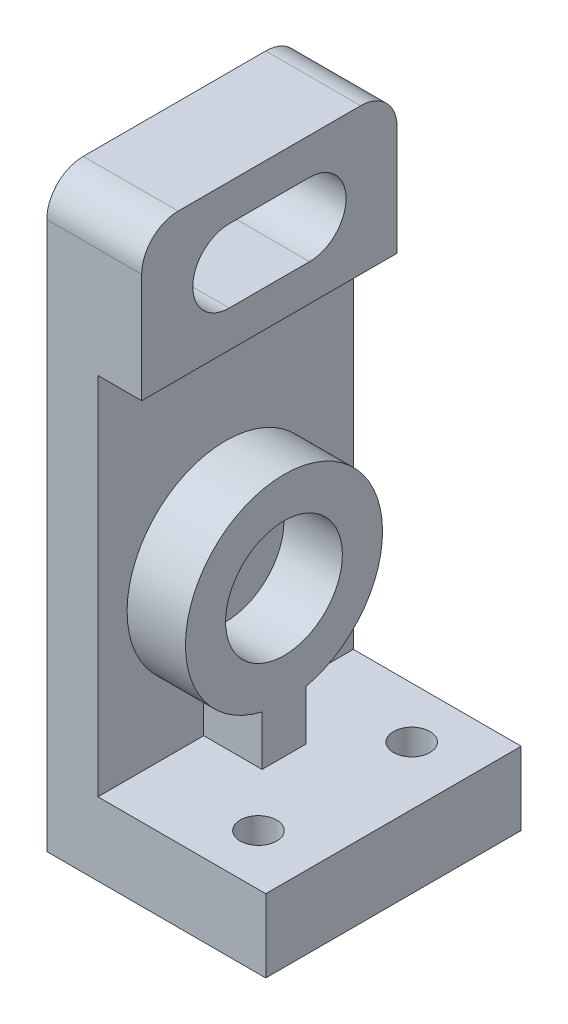
ISO-10303-21;
HEADER;
FILE_DESCRIPTION(('STEP AP214'),'2;1');
FILE_NAME('part.step','',(''),(''),'','','');
FILE_SCHEMA(('AUTOMOTIVE_DESIGN { 1 0 10303 214 1 1 1 1 }'));
ENDSEC;
DATA;
#1=APPLICATION_CONTEXT('core data for automotive mechanical design processes');
#2=APPLICATION_PROTOCOL_DEFINITION('international standard','automotive_design',2000,#1);
#3=PRODUCT_CONTEXT('',#1,'mechanical');
#4=PRODUCT('Part','Part','',(#3));
#5=PRODUCT_RELATED_PRODUCT_CATEGORY('part','',(#4));
#6=PRODUCT_DEFINITION_FORMATION('','',#4);
#7=PRODUCT_DEFINITION_CONTEXT('part definition',#1,'design');
#8=PRODUCT_DEFINITION('design','',#6,#7);
#9=PRODUCT_DEFINITION_SHAPE('','',#8);
#10=(LENGTH_UNIT() NAMED_UNIT(*) SI_UNIT(.MILLI.,.METRE.));
#11=(NAMED_UNIT(*) PLANE_ANGLE_UNIT() SI_UNIT($,.RADIAN.));
#12=(NAMED_UNIT(*) SI_UNIT($,.STERADIAN.) SOLID_ANGLE_UNIT());
#13=UNCERTAINTY_MEASURE_WITH_UNIT(LENGTH_MEASURE(1.E-05),#10,'distance_accuracy_value','');
#14=(GEOMETRIC_REPRESENTATION_CONTEXT(3) GLOBAL_UNCERTAINTY_ASSIGNED_CONTEXT((#13)) GLOBAL_UNIT_ASSIGNED_CONTEXT((#10,
#11,#12)) REPRESENTATION_CONTEXT('',''));
#15=CARTESIAN_POINT('',(0.,0.,0.));
#16=DIRECTION('',(0.,0.,1.));
#17=DIRECTION('',(1.,0.,0.));
#18=AXIS2_PLACEMENT_3D('',#15,#16,#17);
#19=CARTESIAN_POINT('',(0.,10.,0.));
#20=DIRECTION('',(0.,1.,0.));
#21=DIRECTION('',(0.,0.,1.));
#22=AXIS2_PLACEMENT_3D('',#19,#20,#21);
#23=PLANE('',#22);
#24=CARTESIAN_POINT('',(7.,10.,-10.5));
#25=DIRECTION('',(0.,1.,0.));
#26=DIRECTION('',(0.,0.,1.));
#27=AXIS2_PLACEMENT_3D('',#24,#25,#26);
#28=CIRCLE('',#27,2.5);
#29=CARTESIAN_POINT('',(7.,10.,-8.));
#30=VERTEX_POINT('',#29);
#31=EDGE_CURVE('E204',#30,#30,#28,.T.);
#32=ORIENTED_EDGE('',*,*,#31,.F.);
#33=EDGE_LOOP('',(#32));
#34=FACE_BOUND('',#33,.T.);
#35=CARTESIAN_POINT('',(7.,10.,10.5));
#36=DIRECTION('',(0.,1.,0.));
#37=DIRECTION('',(0.,0.,1.));
#38=AXIS2_PLACEMENT_3D('',#35,#36,#37);
#39=CIRCLE('',#38,2.5);
#40=CARTESIAN_POINT('',(7.,10.,13.));
#41=VERTEX_POINT('',#40);
#42=EDGE_CURVE('E180',#41,#41,#39,.T.);
#43=ORIENTED_EDGE('',*,*,#42,.F.);
#44=EDGE_LOOP('',(#43));
#45=FACE_BOUND('',#44,.T.);
#46=DIRECTION('',(0.,0.,-1.));
#47=VECTOR('',#46,1.);
#48=CARTESIAN_POINT('',(0.,10.,3.));
#49=LINE('',#48,#47);
#50=CARTESIAN_POINT('',(0.,10.,3.));
#51=VERTEX_POINT('',#50);
#52=CARTESIAN_POINT('',(0.,10.,-3.));
#53=VERTEX_POINT('',#52);
#54=EDGE_CURVE('E163',#51,#53,#49,.T.);
#55=ORIENTED_EDGE('',*,*,#54,.F.);
#56=DIRECTION('',(-1.,0.,0.));
#57=VECTOR('',#56,1.);
#58=CARTESIAN_POINT('',(0.,10.,3.));
#59=LINE('',#58,#57);
#60=CARTESIAN_POINT('',(-8.,10.,3.));
#61=VERTEX_POINT('',#60);
#62=EDGE_CURVE('E173',#51,#61,#59,.T.);
#63=ORIENTED_EDGE('',*,*,#62,.T.);
#64=DIRECTION('',(0.,0.,-1.));
#65=VECTOR('',#64,1.);
#66=CARTESIAN_POINT('',(-8.,10.,17.5));
#67=LINE('',#66,#65);
#68=CARTESIAN_POINT('',(-8.,10.,17.5));
#69=VERTEX_POINT('',#68);
#70=EDGE_CURVE('E263',#69,#61,#67,.T.);
#71=ORIENTED_EDGE('',*,*,#70,.F.);
#72=DIRECTION('',(1.,0.,0.));
#73=VECTOR('',#72,1.);
#74=CARTESIAN_POINT('',(-15.,10.,17.5));
#75=LINE('',#74,#73);
#76=CARTESIAN_POINT('',(15.,10.,17.5));
#77=VERTEX_POINT('',#76);
#78=EDGE_CURVE('E277',#69,#77,#75,.T.);
#79=ORIENTED_EDGE('',*,*,#78,.T.);
#80=DIRECTION('',(0.,0.,-1.));
#81=VECTOR('',#80,1.);
#82=CARTESIAN_POINT('',(15.,10.,-17.5));
#83=LINE('',#82,#81);
#84=CARTESIAN_POINT('',(15.,10.,-17.5));
#85=VERTEX_POINT('',#84);
#86=EDGE_CURVE('E270',#77,#85,#83,.T.);
#87=ORIENTED_EDGE('',*,*,#86,.T.);
#88=DIRECTION('',(-1.,0.,0.));
#89=VECTOR('',#88,1.);
#90=CARTESIAN_POINT('',(-15.,10.,-17.5));
#91=LINE('',#90,#89);
#92=CARTESIAN_POINT('',(-8.,10.,-17.5));
#93=VERTEX_POINT('',#92);
#94=EDGE_CURVE('E273',#85,#93,#91,.T.);
#95=ORIENTED_EDGE('',*,*,#94,.T.);
#96=CARTESIAN_POINT('',(-8.,10.,-3.));
#97=VERTEX_POINT('',#96);
#98=EDGE_CURVE('E258',#97,#93,#67,.T.);
#99=ORIENTED_EDGE('',*,*,#98,.F.);
#100=DIRECTION('',(-1.,0.,0.));
#101=VECTOR('',#100,1.);
#102=CARTESIAN_POINT('',(0.,10.,-3.));
#103=LINE('',#102,#101);
#104=EDGE_CURVE('E181',#53,#97,#103,.T.);
#105=ORIENTED_EDGE('',*,*,#104,.F.);
#106=EDGE_LOOP('',(#55,#63,#71,#79,#87,#95,#99,#105));
#107=FACE_BOUND('',#106,.T.);
#108=ADVANCED_FACE('F35',(#34,#45,#107),#23,.T.);
#109=CARTESIAN_POINT('',(-8.,80.,17.5));
#110=DIRECTION('',(-1.,0.,0.));
#111=DIRECTION('',(0.,0.,1.));
#112=AXIS2_PLACEMENT_3D('',#109,#110,#111);
#113=PLANE('',#112);
#114=DIRECTION('',(0.,-1.,0.));
#115=VECTOR('',#114,1.);
#116=CARTESIAN_POINT('',(-8.,10.,3.));
#117=LINE('',#116,#115);
#118=CARTESIAN_POINT('',(-8.,16.8375534189118,3.00000000000001));
#119=VERTEX_POINT('',#118);
#120=EDGE_CURVE('E176',#119,#61,#117,.T.);
#121=ORIENTED_EDGE('',*,*,#120,.F.);
#122=CARTESIAN_POINT('',(-8.,30.,0.));
#123=DIRECTION('',(1.,0.,0.));
#124=DIRECTION('',(0.,0.,-1.));
#125=AXIS2_PLACEMENT_3D('',#122,#123,#124);
#126=CIRCLE('',#125,13.5);
#127=CARTESIAN_POINT('',(-8.,16.8375534189118,-3.));
#128=VERTEX_POINT('',#127);
#129=EDGE_CURVE('E170',#128,#119,#126,.T.);
#130=ORIENTED_EDGE('',*,*,#129,.F.);
#131=DIRECTION('',(0.,1.,0.));
#132=VECTOR('',#131,1.);
#133=CARTESIAN_POINT('',(-8.,10.,-3.));
#134=LINE('',#133,#132);
#135=EDGE_CURVE('E191',#97,#128,#134,.T.);
#136=ORIENTED_EDGE('',*,*,#135,.F.);
#137=ORIENTED_EDGE('',*,*,#98,.T.);
#138=DIRECTION('',(0.,-1.,0.));
#139=VECTOR('',#138,1.);
#140=CARTESIAN_POINT('',(-8.,80.,-17.5));
#141=LINE('',#140,#139);
#142=CARTESIAN_POINT('',(-8.,60.,-17.5));
#143=VERTEX_POINT('',#142);
#144=EDGE_CURVE('E262',#143,#93,#141,.T.);
#145=ORIENTED_EDGE('',*,*,#144,.F.);
#146=DIRECTION('',(0.,0.,-1.));
#147=VECTOR('',#146,1.);
#148=CARTESIAN_POINT('',(-8.,60.,17.5));
#149=LINE('',#148,#147);
#150=CARTESIAN_POINT('',(-8.,60.,17.5));
#151=VERTEX_POINT('',#150);
#152=EDGE_CURVE('E235',#151,#143,#149,.T.);
#153=ORIENTED_EDGE('',*,*,#152,.F.);
#154=DIRECTION('',(0.,-1.,0.));
#155=VECTOR('',#154,1.);
#156=CARTESIAN_POINT('',(-8.,80.,17.5));
#157=LINE('',#156,#155);
#158=EDGE_CURVE('E267',#151,#69,#157,.T.);
#159=ORIENTED_EDGE('',*,*,#158,.T.);
#160=ORIENTED_EDGE('',*,*,#70,.T.);
#161=EDGE_LOOP('',(#121,#130,#136,#137,#145,#153,#159,#160));
#162=FACE_BOUND('',#161,.T.);
#163=ADVANCED_FACE('F352',(#162),#113,.F.);
#164=CARTESIAN_POINT('',(15.,10.,-17.5));
#165=DIRECTION('',(-1.,0.,0.));
#166=DIRECTION('',(0.,0.,1.));
#167=AXIS2_PLACEMENT_3D('',#164,#165,#166);
#168=PLANE('',#167);
#169=DIRECTION('',(0.,0.,-1.));
#170=VECTOR('',#169,1.);
#171=CARTESIAN_POINT('',(15.,0.,-17.5));
#172=LINE('',#171,#170);
#173=CARTESIAN_POINT('',(15.,0.,17.5));
#174=VERTEX_POINT('',#173);
#175=CARTESIAN_POINT('',(15.,0.,-17.5));
#176=VERTEX_POINT('',#175);
#177=EDGE_CURVE('E269',#174,#176,#172,.T.);
#178=ORIENTED_EDGE('',*,*,#177,.T.);
#179=DIRECTION('',(0.,-1.,0.));
#180=VECTOR('',#179,1.);
#181=CARTESIAN_POINT('',(15.,10.,-17.5));
#182=LINE('',#181,#180);
#183=EDGE_CURVE('E295',#85,#176,#182,.T.);
#184=ORIENTED_EDGE('',*,*,#183,.F.);
#185=ORIENTED_EDGE('',*,*,#86,.F.);
#186=DIRECTION('',(0.,-1.,0.));
#187=VECTOR('',#186,1.);
#188=CARTESIAN_POINT('',(15.,10.,17.5));
#189=LINE('',#188,#187);
#190=EDGE_CURVE('E279',#77,#174,#189,.T.);
#191=ORIENTED_EDGE('',*,*,#190,.T.);
#192=EDGE_LOOP('',(#178,#184,#185,#191));
#193=FACE_BOUND('',#192,.T.);
#194=ADVANCED_FACE('F357',(#193),#168,.F.);
#195=CARTESIAN_POINT('',(-15.,10.,-17.5));
#196=DIRECTION('',(0.,0.,1.));
#197=DIRECTION('',(1.,0.,0.));
#198=AXIS2_PLACEMENT_3D('',#195,#196,#197);
#199=PLANE('',#198);
#200=DIRECTION('',(0.,-1.,0.));
#201=VECTOR('',#200,1.);
#202=CARTESIAN_POINT('',(-15.,10.,-17.5));
#203=LINE('',#202,#201);
#204=CARTESIAN_POINT('',(-15.,75.,-17.5));
#205=VERTEX_POINT('',#204);
#206=CARTESIAN_POINT('',(-15.,0.,-17.5));
#207=VERTEX_POINT('',#206);
#208=EDGE_CURVE('E293',#205,#207,#203,.T.);
#209=ORIENTED_EDGE('',*,*,#208,.F.);
#210=DIRECTION('',(-1.,0.,0.));
#211=VECTOR('',#210,1.);
#212=CARTESIAN_POINT('',(-15.,75.,-17.5));
#213=LINE('',#212,#211);
#214=CARTESIAN_POINT('',(-2.,75.,-17.5));
#215=VERTEX_POINT('',#214);
#216=EDGE_CURVE('E308',#205,#215,#213,.F.);
#217=ORIENTED_EDGE('',*,*,#216,.T.);
#218=DIRECTION('',(0.,1.,0.));
#219=VECTOR('',#218,1.);
#220=CARTESIAN_POINT('',(-2.,80.,-17.5));
#221=LINE('',#220,#219);
#222=CARTESIAN_POINT('',(-2.,60.,-17.5));
#223=VERTEX_POINT('',#222);
#224=EDGE_CURVE('E246',#223,#215,#221,.T.);
#225=ORIENTED_EDGE('',*,*,#224,.F.);
#226=DIRECTION('',(-1.,0.,0.));
#227=VECTOR('',#226,1.);
#228=CARTESIAN_POINT('',(-2.,60.,-17.5));
#229=LINE('',#228,#227);
#230=EDGE_CURVE('E252',#223,#143,#229,.T.);
#231=ORIENTED_EDGE('',*,*,#230,.T.);
#232=ORIENTED_EDGE('',*,*,#144,.T.);
#233=ORIENTED_EDGE('',*,*,#94,.F.);
#234=ORIENTED_EDGE('',*,*,#183,.T.);
#235=DIRECTION('',(-1.,0.,0.));
#236=VECTOR('',#235,1.);
#237=CARTESIAN_POINT('',(-15.,0.,-17.5));
#238=LINE('',#237,#236);
#239=EDGE_CURVE('E282',#176,#207,#238,.T.);
#240=ORIENTED_EDGE('',*,*,#239,.T.);
#241=EDGE_LOOP('',(#209,#217,#225,#231,#232,#233,#234,#240));
#242=FACE_BOUND('',#241,.T.);
#243=ADVANCED_FACE('F328',(#242),#199,.F.);
#244=CARTESIAN_POINT('',(-15.,10.,-17.5));
#245=DIRECTION('',(1.,0.,0.));
#246=DIRECTION('',(0.,0.,-1.));
#247=AXIS2_PLACEMENT_3D('',#244,#245,#246);
#248=PLANE('',#247);
#249=DIRECTION('',(0.,0.,1.));
#250=VECTOR('',#249,1.);
#251=CARTESIAN_POINT('',(-15.,75.,5.5));
#252=LINE('',#251,#250);
#253=CARTESIAN_POINT('',(-15.,75.,-5.5));
#254=VERTEX_POINT('',#253);
#255=CARTESIAN_POINT('',(-15.,75.,5.5));
#256=VERTEX_POINT('',#255);
#257=EDGE_CURVE('E220',#254,#256,#252,.T.);
#258=ORIENTED_EDGE('',*,*,#257,.T.);
#259=CARTESIAN_POINT('',(-15.,70.,5.5));
#260=DIRECTION('',(1.,0.,0.));
#261=DIRECTION('',(0.,0.,-1.));
#262=AXIS2_PLACEMENT_3D('',#259,#260,#261);
#263=CIRCLE('',#262,4.99999999999999);
#264=CARTESIAN_POINT('',(-15.,65.,5.5));
#265=VERTEX_POINT('',#264);
#266=EDGE_CURVE('E212',#256,#265,#263,.T.);
#267=ORIENTED_EDGE('',*,*,#266,.T.);
#268=DIRECTION('',(0.,0.,-1.));
#269=VECTOR('',#268,1.);
#270=CARTESIAN_POINT('',(-15.,65.,5.5));
#271=LINE('',#270,#269);
#272=CARTESIAN_POINT('',(-15.,65.,-5.5));
#273=VERTEX_POINT('',#272);
#274=EDGE_CURVE('E215',#265,#273,#271,.T.);
#275=ORIENTED_EDGE('',*,*,#274,.T.);
#276=CARTESIAN_POINT('',(-15.,70.,-5.5));
#277=DIRECTION('',(1.,0.,0.));
#278=DIRECTION('',(0.,0.,-1.));
#279=AXIS2_PLACEMENT_3D('',#276,#277,#278);
#280=CIRCLE('',#279,4.99999999999999);
#281=EDGE_CURVE('E58',#273,#254,#280,.T.);
#282=ORIENTED_EDGE('',*,*,#281,.T.);
#283=EDGE_LOOP('',(#258,#267,#275,#282));
#284=FACE_BOUND('',#283,.T.);
#285=DIRECTION('',(0.,0.,1.));
#286=VECTOR('',#285,1.);
#287=CARTESIAN_POINT('',(-15.,80.,17.5));
#288=LINE('',#287,#286);
#289=CARTESIAN_POINT('',(-15.,80.,-12.5));
#290=VERTEX_POINT('',#289);
#291=CARTESIAN_POINT('',(-15.,80.,12.5));
#292=VERTEX_POINT('',#291);
#293=EDGE_CURVE('E259',#290,#292,#288,.T.);
#294=ORIENTED_EDGE('',*,*,#293,.F.);
#295=CARTESIAN_POINT('',(-15.,75.,-12.5));
#296=DIRECTION('',(1.,0.,0.));
#297=DIRECTION('',(0.,0.,-1.));
#298=AXIS2_PLACEMENT_3D('',#295,#296,#297);
#299=CIRCLE('',#298,5.);
#300=EDGE_CURVE('E306',#290,#205,#299,.F.);
#301=ORIENTED_EDGE('',*,*,#300,.T.);
#302=ORIENTED_EDGE('',*,*,#208,.T.);
#303=DIRECTION('',(0.,0.,1.));
#304=VECTOR('',#303,1.);
#305=CARTESIAN_POINT('',(-15.,0.,-17.5));
#306=LINE('',#305,#304);
#307=CARTESIAN_POINT('',(-15.,0.,17.5));
#308=VERTEX_POINT('',#307);
#309=EDGE_CURVE('E285',#207,#308,#306,.T.);
#310=ORIENTED_EDGE('',*,*,#309,.T.);
#311=DIRECTION('',(0.,-1.,0.));
#312=VECTOR('',#311,1.);
#313=CARTESIAN_POINT('',(-15.,10.,17.5));
#314=LINE('',#313,#312);
#315=CARTESIAN_POINT('',(-15.,75.,17.5));
#316=VERTEX_POINT('',#315);
#317=EDGE_CURVE('E291',#316,#308,#314,.T.);
#318=ORIENTED_EDGE('',*,*,#317,.F.);
#319=CARTESIAN_POINT('',(-15.,75.,12.5));
#320=DIRECTION('',(1.,0.,0.));
#321=DIRECTION('',(0.,0.,-1.));
#322=AXIS2_PLACEMENT_3D('',#319,#320,#321);
#323=CIRCLE('',#322,5.);
#324=EDGE_CURVE('E304',#316,#292,#323,.F.);
#325=ORIENTED_EDGE('',*,*,#324,.T.);
#326=EDGE_LOOP('',(#294,#301,#302,#310,#318,#325));
#327=FACE_BOUND('',#326,.T.);
#328=ADVANCED_FACE('F326',(#284,#327),#248,.F.);
#329=CARTESIAN_POINT('',(-15.,10.,17.5));
#330=DIRECTION('',(0.,0.,-1.));
#331=DIRECTION('',(-1.,0.,0.));
#332=AXIS2_PLACEMENT_3D('',#329,#330,#331);
#333=PLANE('',#332);
#334=DIRECTION('',(0.,-1.,0.));
#335=VECTOR('',#334,1.);
#336=CARTESIAN_POINT('',(-2.,80.,17.5));
#337=LINE('',#336,#335);
#338=CARTESIAN_POINT('',(-2.,75.,17.5));
#339=VERTEX_POINT('',#338);
#340=CARTESIAN_POINT('',(-2.,60.,17.5));
#341=VERTEX_POINT('',#340);
#342=EDGE_CURVE('E242',#339,#341,#337,.T.);
#343=ORIENTED_EDGE('',*,*,#342,.F.);
#344=DIRECTION('',(1.,0.,0.));
#345=VECTOR('',#344,1.);
#346=CARTESIAN_POINT('',(-15.,75.,17.5));
#347=LINE('',#346,#345);
#348=EDGE_CURVE('E11',#339,#316,#347,.F.);
#349=ORIENTED_EDGE('',*,*,#348,.T.);
#350=ORIENTED_EDGE('',*,*,#317,.T.);
#351=DIRECTION('',(1.,0.,0.));
#352=VECTOR('',#351,1.);
#353=CARTESIAN_POINT('',(-15.,0.,17.5));
#354=LINE('',#353,#352);
#355=EDGE_CURVE('E274',#308,#174,#354,.T.);
#356=ORIENTED_EDGE('',*,*,#355,.T.);
#357=ORIENTED_EDGE('',*,*,#190,.F.);
#358=ORIENTED_EDGE('',*,*,#78,.F.);
#359=ORIENTED_EDGE('',*,*,#158,.F.);
#360=DIRECTION('',(-1.,0.,0.));
#361=VECTOR('',#360,1.);
#362=CARTESIAN_POINT('',(-2.,60.,17.5));
#363=LINE('',#362,#361);
#364=EDGE_CURVE('E256',#341,#151,#363,.T.);
#365=ORIENTED_EDGE('',*,*,#364,.F.);
#366=EDGE_LOOP('',(#343,#349,#350,#356,#357,#358,#359,#365));
#367=FACE_BOUND('',#366,.T.);
#368=ADVANCED_FACE('F343',(#367),#333,.F.);
#369=CARTESIAN_POINT('',(0.,0.,0.));
#370=DIRECTION('',(0.,1.,0.));
#371=DIRECTION('',(0.,0.,1.));
#372=AXIS2_PLACEMENT_3D('',#369,#370,#371);
#373=PLANE('',#372);
#374=CARTESIAN_POINT('',(7.,0.,-10.5));
#375=DIRECTION('',(0.,1.,0.));
#376=DIRECTION('',(0.,0.,1.));
#377=AXIS2_PLACEMENT_3D('',#374,#375,#376);
#378=CIRCLE('',#377,2.5);
#379=CARTESIAN_POINT('',(7.,0.,-8.));
#380=VERTEX_POINT('',#379);
#381=EDGE_CURVE('E200',#380,#380,#378,.T.);
#382=ORIENTED_EDGE('',*,*,#381,.T.);
#383=EDGE_LOOP('',(#382));
#384=FACE_BOUND('',#383,.T.);
#385=CARTESIAN_POINT('',(7.,0.,10.5));
#386=DIRECTION('',(0.,1.,0.));
#387=DIRECTION('',(0.,0.,1.));
#388=AXIS2_PLACEMENT_3D('',#385,#386,#387);
#389=CIRCLE('',#388,2.5);
#390=CARTESIAN_POINT('',(7.,0.,13.));
#391=VERTEX_POINT('',#390);
#392=EDGE_CURVE('E207',#391,#391,#389,.T.);
#393=ORIENTED_EDGE('',*,*,#392,.T.);
#394=EDGE_LOOP('',(#393));
#395=FACE_BOUND('',#394,.T.);
#396=ORIENTED_EDGE('',*,*,#177,.F.);
#397=ORIENTED_EDGE('',*,*,#355,.F.);
#398=ORIENTED_EDGE('',*,*,#309,.F.);
#399=ORIENTED_EDGE('',*,*,#239,.F.);
#400=EDGE_LOOP('',(#396,#397,#398,#399));
#401=FACE_BOUND('',#400,.T.);
#402=ADVANCED_FACE('F334',(#384,#395,#401),#373,.F.);
#403=CARTESIAN_POINT('',(0.,80.,0.));
#404=DIRECTION('',(0.,-1.,0.));
#405=DIRECTION('',(0.,0.,-1.));
#406=AXIS2_PLACEMENT_3D('',#403,#404,#405);
#407=PLANE('',#406);
#408=DIRECTION('',(0.,0.,1.));
#409=VECTOR('',#408,1.);
#410=CARTESIAN_POINT('',(-2.,80.,17.5));
#411=LINE('',#410,#409);
#412=CARTESIAN_POINT('',(-2.,80.,-12.5));
#413=VERTEX_POINT('',#412);
#414=CARTESIAN_POINT('',(-2.,80.,12.5));
#415=VERTEX_POINT('',#414);
#416=EDGE_CURVE('E249',#413,#415,#411,.T.);
#417=ORIENTED_EDGE('',*,*,#416,.F.);
#418=DIRECTION('',(-1.,0.,0.));
#419=VECTOR('',#418,1.);
#420=CARTESIAN_POINT('',(0.,80.,-12.5));
#421=LINE('',#420,#419);
#422=EDGE_CURVE('E301',#413,#290,#421,.T.);
#423=ORIENTED_EDGE('',*,*,#422,.T.);
#424=ORIENTED_EDGE('',*,*,#293,.T.);
#425=DIRECTION('',(1.,0.,0.));
#426=VECTOR('',#425,1.);
#427=CARTESIAN_POINT('',(0.,80.,12.5));
#428=LINE('',#427,#426);
#429=EDGE_CURVE('E298',#292,#415,#428,.T.);
#430=ORIENTED_EDGE('',*,*,#429,.T.);
#431=EDGE_LOOP('',(#417,#423,#424,#430));
#432=FACE_BOUND('',#431,.T.);
#433=ADVANCED_FACE('F320',(#432),#407,.F.);
#434=CARTESIAN_POINT('',(-2.,60.,17.5));
#435=DIRECTION('',(0.,1.,0.));
#436=DIRECTION('',(0.,0.,1.));
#437=AXIS2_PLACEMENT_3D('',#434,#435,#436);
#438=PLANE('',#437);
#439=ORIENTED_EDGE('',*,*,#152,.T.);
#440=ORIENTED_EDGE('',*,*,#230,.F.);
#441=DIRECTION('',(0.,0.,-1.));
#442=VECTOR('',#441,1.);
#443=CARTESIAN_POINT('',(-2.,60.,17.5));
#444=LINE('',#443,#442);
#445=EDGE_CURVE('E244',#341,#223,#444,.T.);
#446=ORIENTED_EDGE('',*,*,#445,.F.);
#447=ORIENTED_EDGE('',*,*,#364,.T.);
#448=EDGE_LOOP('',(#439,#440,#446,#447));
#449=FACE_BOUND('',#448,.T.);
#450=ADVANCED_FACE('F348',(#449),#438,.F.);
#451=CARTESIAN_POINT('',(-2.,0.,0.));
#452=DIRECTION('',(1.,0.,0.));
#453=DIRECTION('',(0.,0.,-1.));
#454=AXIS2_PLACEMENT_3D('',#451,#452,#453);
#455=PLANE('',#454);
#456=CARTESIAN_POINT('',(-2.,70.,5.5));
#457=DIRECTION('',(1.,0.,0.));
#458=DIRECTION('',(0.,0.,-1.));
#459=AXIS2_PLACEMENT_3D('',#456,#457,#458);
#460=CIRCLE('',#459,4.99999999999999);
#461=CARTESIAN_POINT('',(-2.,75.,5.5));
#462=VERTEX_POINT('',#461);
#463=CARTESIAN_POINT('',(-2.,65.,5.5));
#464=VERTEX_POINT('',#463);
#465=EDGE_CURVE('E203',#462,#464,#460,.T.);
#466=ORIENTED_EDGE('',*,*,#465,.F.);
#467=DIRECTION('',(0.,0.,1.));
#468=VECTOR('',#467,1.);
#469=CARTESIAN_POINT('',(-2.,75.,5.5));
#470=LINE('',#469,#468);
#471=CARTESIAN_POINT('',(-2.,75.,-5.5));
#472=VERTEX_POINT('',#471);
#473=EDGE_CURVE('E216',#472,#462,#470,.T.);
#474=ORIENTED_EDGE('',*,*,#473,.F.);
#475=CARTESIAN_POINT('',(-2.,70.,-5.5));
#476=DIRECTION('',(1.,0.,0.));
#477=DIRECTION('',(0.,0.,-1.));
#478=AXIS2_PLACEMENT_3D('',#475,#476,#477);
#479=CIRCLE('',#478,4.99999999999999);
#480=CARTESIAN_POINT('',(-2.,65.,-5.5));
#481=VERTEX_POINT('',#480);
#482=EDGE_CURVE('E228',#481,#472,#479,.T.);
#483=ORIENTED_EDGE('',*,*,#482,.F.);
#484=DIRECTION('',(0.,0.,-1.));
#485=VECTOR('',#484,1.);
#486=CARTESIAN_POINT('',(-2.,65.,5.5));
#487=LINE('',#486,#485);
#488=EDGE_CURVE('E225',#464,#481,#487,.T.);
#489=ORIENTED_EDGE('',*,*,#488,.F.);
#490=EDGE_LOOP('',(#466,#474,#483,#489));
#491=FACE_BOUND('',#490,.T.);
#492=ORIENTED_EDGE('',*,*,#224,.T.);
#493=CARTESIAN_POINT('',(-2.,75.,-12.5));
#494=DIRECTION('',(1.,0.,0.));
#495=DIRECTION('',(0.,0.,-1.));
#496=AXIS2_PLACEMENT_3D('',#493,#494,#495);
#497=CIRCLE('',#496,5.);
#498=EDGE_CURVE('E43',#215,#413,#497,.T.);
#499=ORIENTED_EDGE('',*,*,#498,.T.);
#500=ORIENTED_EDGE('',*,*,#416,.T.);
#501=CARTESIAN_POINT('',(-2.,75.,12.5));
#502=DIRECTION('',(1.,0.,0.));
#503=DIRECTION('',(0.,0.,-1.));
#504=AXIS2_PLACEMENT_3D('',#501,#502,#503);
#505=CIRCLE('',#504,5.);
#506=EDGE_CURVE('E310',#415,#339,#505,.T.);
#507=ORIENTED_EDGE('',*,*,#506,.T.);
#508=ORIENTED_EDGE('',*,*,#342,.T.);
#509=ORIENTED_EDGE('',*,*,#445,.T.);
#510=EDGE_LOOP('',(#492,#499,#500,#507,#508,#509));
#511=FACE_BOUND('',#510,.T.);
#512=ADVANCED_FACE('F314',(#491,#511),#455,.T.);
#513=CARTESIAN_POINT('',(0.,75.,-12.5));
#514=DIRECTION('',(-1.,0.,0.));
#515=DIRECTION('',(0.,0.,1.));
#516=AXIS2_PLACEMENT_3D('',#513,#514,#515);
#517=CYLINDRICAL_SURFACE('',#516,5.);
#518=ORIENTED_EDGE('',*,*,#498,.F.);
#519=ORIENTED_EDGE('',*,*,#216,.F.);
#520=ORIENTED_EDGE('',*,*,#300,.F.);
#521=ORIENTED_EDGE('',*,*,#422,.F.);
#522=EDGE_LOOP('',(#518,#519,#520,#521));
#523=FACE_BOUND('',#522,.T.);
#524=ADVANCED_FACE('F323',(#523),#517,.T.);
#525=CARTESIAN_POINT('',(0.,75.,12.5));
#526=DIRECTION('',(1.,0.,0.));
#527=DIRECTION('',(0.,0.,-1.));
#528=AXIS2_PLACEMENT_3D('',#525,#526,#527);
#529=CYLINDRICAL_SURFACE('',#528,5.);
#530=ORIENTED_EDGE('',*,*,#324,.F.);
#531=ORIENTED_EDGE('',*,*,#348,.F.);
#532=ORIENTED_EDGE('',*,*,#506,.F.);
#533=ORIENTED_EDGE('',*,*,#429,.F.);
#534=EDGE_LOOP('',(#530,#531,#532,#533));
#535=FACE_BOUND('',#534,.T.);
#536=ADVANCED_FACE('F37',(#535),#529,.T.);
#537=CARTESIAN_POINT('',(-15.,70.,5.5));
#538=DIRECTION('',(1.,0.,0.));
#539=DIRECTION('',(0.,0.,-1.));
#540=AXIS2_PLACEMENT_3D('',#537,#538,#539);
#541=CYLINDRICAL_SURFACE('',#540,4.99999999999999);
#542=ORIENTED_EDGE('',*,*,#465,.T.);
#543=DIRECTION('',(1.,0.,0.));
#544=VECTOR('',#543,1.);
#545=CARTESIAN_POINT('',(-15.,65.,5.5));
#546=LINE('',#545,#544);
#547=EDGE_CURVE('E223',#265,#464,#546,.T.);
#548=ORIENTED_EDGE('',*,*,#547,.F.);
#549=ORIENTED_EDGE('',*,*,#266,.F.);
#550=DIRECTION('',(1.,0.,0.));
#551=VECTOR('',#550,1.);
#552=CARTESIAN_POINT('',(-15.,75.,5.5));
#553=LINE('',#552,#551);
#554=EDGE_CURVE('E233',#256,#462,#553,.T.);
#555=ORIENTED_EDGE('',*,*,#554,.T.);
#556=EDGE_LOOP('',(#542,#548,#549,#555));
#557=FACE_BOUND('',#556,.T.);
#558=ADVANCED_FACE('F392',(#557),#541,.F.);
#559=CARTESIAN_POINT('',(-15.,75.,5.5));
#560=DIRECTION('',(0.,1.,0.));
#561=DIRECTION('',(0.,0.,1.));
#562=AXIS2_PLACEMENT_3D('',#559,#560,#561);
#563=PLANE('',#562);
#564=ORIENTED_EDGE('',*,*,#473,.T.);
#565=ORIENTED_EDGE('',*,*,#554,.F.);
#566=ORIENTED_EDGE('',*,*,#257,.F.);
#567=DIRECTION('',(1.,0.,0.));
#568=VECTOR('',#567,1.);
#569=CARTESIAN_POINT('',(-15.,75.,-5.5));
#570=LINE('',#569,#568);
#571=EDGE_CURVE('E236',#254,#472,#570,.T.);
#572=ORIENTED_EDGE('',*,*,#571,.T.);
#573=EDGE_LOOP('',(#564,#565,#566,#572));
#574=FACE_BOUND('',#573,.T.);
#575=ADVANCED_FACE('F388',(#574),#563,.F.);
#576=CARTESIAN_POINT('',(-15.,70.,-5.5));
#577=DIRECTION('',(1.,0.,0.));
#578=DIRECTION('',(0.,0.,-1.));
#579=AXIS2_PLACEMENT_3D('',#576,#577,#578);
#580=CYLINDRICAL_SURFACE('',#579,4.99999999999999);
#581=ORIENTED_EDGE('',*,*,#482,.T.);
#582=ORIENTED_EDGE('',*,*,#571,.F.);
#583=ORIENTED_EDGE('',*,*,#281,.F.);
#584=DIRECTION('',(1.,0.,0.));
#585=VECTOR('',#584,1.);
#586=CARTESIAN_POINT('',(-15.,65.,-5.5));
#587=LINE('',#586,#585);
#588=EDGE_CURVE('E238',#273,#481,#587,.T.);
#589=ORIENTED_EDGE('',*,*,#588,.T.);
#590=EDGE_LOOP('',(#581,#582,#583,#589));
#591=FACE_BOUND('',#590,.T.);
#592=ADVANCED_FACE('F398',(#591),#580,.F.);
#593=CARTESIAN_POINT('',(-15.,65.,5.5));
#594=DIRECTION('',(0.,-1.,0.));
#595=DIRECTION('',(0.,0.,-1.));
#596=AXIS2_PLACEMENT_3D('',#593,#594,#595);
#597=PLANE('',#596);
#598=ORIENTED_EDGE('',*,*,#488,.T.);
#599=ORIENTED_EDGE('',*,*,#588,.F.);
#600=ORIENTED_EDGE('',*,*,#274,.F.);
#601=ORIENTED_EDGE('',*,*,#547,.T.);
#602=EDGE_LOOP('',(#598,#599,#600,#601));
#603=FACE_BOUND('',#602,.T.);
#604=ADVANCED_FACE('F396',(#603),#597,.F.);
#605=CARTESIAN_POINT('',(7.,0.,10.5));
#606=DIRECTION('',(0.,1.,0.));
#607=DIRECTION('',(0.,0.,1.));
#608=AXIS2_PLACEMENT_3D('',#605,#606,#607);
#609=CYLINDRICAL_SURFACE('',#608,2.5);
#610=ORIENTED_EDGE('',*,*,#392,.F.);
#611=EDGE_LOOP('',(#610));
#612=FACE_BOUND('',#611,.T.);
#613=ORIENTED_EDGE('',*,*,#42,.T.);
#614=EDGE_LOOP('',(#613));
#615=FACE_BOUND('',#614,.T.);
#616=ADVANCED_FACE('F519',(#612,#615),#609,.F.);
#617=CARTESIAN_POINT('',(7.,0.,-10.5));
#618=DIRECTION('',(0.,1.,0.));
#619=DIRECTION('',(0.,0.,1.));
#620=AXIS2_PLACEMENT_3D('',#617,#618,#619);
#621=CYLINDRICAL_SURFACE('',#620,2.5);
#622=ORIENTED_EDGE('',*,*,#381,.F.);
#623=EDGE_LOOP('',(#622));
#624=FACE_BOUND('',#623,.T.);
#625=ORIENTED_EDGE('',*,*,#31,.T.);
#626=EDGE_LOOP('',(#625));
#627=FACE_BOUND('',#626,.T.);
#628=ADVANCED_FACE('F463',(#624,#627),#621,.F.);
#629=CARTESIAN_POINT('',(0.,30.,0.));
#630=DIRECTION('',(1.,0.,0.));
#631=DIRECTION('',(0.,0.,-1.));
#632=AXIS2_PLACEMENT_3D('',#629,#630,#631);
#633=PLANE('',#632);
#634=DIRECTION('',(0.,-1.,0.));
#635=VECTOR('',#634,1.);
#636=CARTESIAN_POINT('',(0.,10.,3.));
#637=LINE('',#636,#635);
#638=CARTESIAN_POINT('',(0.,16.8375534189118,3.00000000000001));
#639=VERTEX_POINT('',#638);
#640=EDGE_CURVE('E158',#639,#51,#637,.T.);
#641=ORIENTED_EDGE('',*,*,#640,.T.);
#642=ORIENTED_EDGE('',*,*,#54,.T.);
#643=DIRECTION('',(0.,1.,0.));
#644=VECTOR('',#643,1.);
#645=CARTESIAN_POINT('',(0.,10.,-3.));
#646=LINE('',#645,#644);
#647=CARTESIAN_POINT('',(0.,16.8375534189118,-3.));
#648=VERTEX_POINT('',#647);
#649=EDGE_CURVE('E50',#53,#648,#646,.T.);
#650=ORIENTED_EDGE('',*,*,#649,.T.);
#651=CARTESIAN_POINT('',(0.,30.,0.));
#652=DIRECTION('',(1.,0.,0.));
#653=DIRECTION('',(0.,0.,-1.));
#654=AXIS2_PLACEMENT_3D('',#651,#652,#653);
#655=CIRCLE('',#654,13.5);
#656=EDGE_CURVE('E166',#648,#639,#655,.T.);
#657=ORIENTED_EDGE('',*,*,#656,.T.);
#658=EDGE_LOOP('',(#641,#642,#650,#657));
#659=FACE_BOUND('',#658,.T.);
#660=CARTESIAN_POINT('',(0.,30.,0.));
#661=DIRECTION('',(1.,0.,0.));
#662=DIRECTION('',(0.,0.,-1.));
#663=AXIS2_PLACEMENT_3D('',#660,#661,#662);
#664=CIRCLE('',#663,8.);
#665=CARTESIAN_POINT('',(0.,30.,-8.));
#666=VERTEX_POINT('',#665);
#667=EDGE_CURVE('E192',#666,#666,#664,.T.);
#668=ORIENTED_EDGE('',*,*,#667,.F.);
#669=EDGE_LOOP('',(#668));
#670=FACE_BOUND('',#669,.T.);
#671=ADVANCED_FACE('F160',(#659,#670),#633,.T.);
#672=CARTESIAN_POINT('',(0.,10.,3.));
#673=DIRECTION('',(0.,0.,-1.));
#674=DIRECTION('',(-1.,0.,0.));
#675=AXIS2_PLACEMENT_3D('',#672,#673,#674);
#676=PLANE('',#675);
#677=ORIENTED_EDGE('',*,*,#120,.T.);
#678=ORIENTED_EDGE('',*,*,#62,.F.);
#679=ORIENTED_EDGE('',*,*,#640,.F.);
#680=DIRECTION('',(-1.,0.,0.));
#681=VECTOR('',#680,1.);
#682=CARTESIAN_POINT('',(0.,16.8375534189118,3.00000000000001));
#683=LINE('',#682,#681);
#684=EDGE_CURVE('E189',#639,#119,#683,.T.);
#685=ORIENTED_EDGE('',*,*,#684,.T.);
#686=EDGE_LOOP('',(#677,#678,#679,#685));
#687=FACE_BOUND('',#686,.T.);
#688=ADVANCED_FACE('F174',(#687),#676,.F.);
#689=CARTESIAN_POINT('',(0.,10.,-3.));
#690=DIRECTION('',(0.,0.,1.));
#691=DIRECTION('',(1.,0.,0.));
#692=AXIS2_PLACEMENT_3D('',#689,#690,#691);
#693=PLANE('',#692);
#694=ORIENTED_EDGE('',*,*,#135,.T.);
#695=DIRECTION('',(-1.,0.,0.));
#696=VECTOR('',#695,1.);
#697=CARTESIAN_POINT('',(0.,16.8375534189118,-3.));
#698=LINE('',#697,#696);
#699=EDGE_CURVE('E196',#648,#128,#698,.T.);
#700=ORIENTED_EDGE('',*,*,#699,.F.);
#701=ORIENTED_EDGE('',*,*,#649,.F.);
#702=ORIENTED_EDGE('',*,*,#104,.T.);
#703=EDGE_LOOP('',(#694,#700,#701,#702));
#704=FACE_BOUND('',#703,.T.);
#705=ADVANCED_FACE('F474',(#704),#693,.F.);
#706=CARTESIAN_POINT('',(0.,30.,0.));
#707=DIRECTION('',(-1.,0.,0.));
#708=DIRECTION('',(0.,0.,1.));
#709=AXIS2_PLACEMENT_3D('',#706,#707,#708);
#710=CYLINDRICAL_SURFACE('',#709,13.5);
#711=ORIENTED_EDGE('',*,*,#129,.T.);
#712=ORIENTED_EDGE('',*,*,#684,.F.);
#713=ORIENTED_EDGE('',*,*,#656,.F.);
#714=ORIENTED_EDGE('',*,*,#699,.T.);
#715=EDGE_LOOP('',(#711,#712,#713,#714));
#716=FACE_BOUND('',#715,.T.);
#717=ADVANCED_FACE('F483',(#716),#710,.T.);
#718=CARTESIAN_POINT('',(0.,30.,0.));
#719=DIRECTION('',(-1.,0.,0.));
#720=DIRECTION('',(0.,0.,1.));
#721=AXIS2_PLACEMENT_3D('',#718,#719,#720);
#722=CYLINDRICAL_SURFACE('',#721,8.);
#723=ORIENTED_EDGE('',*,*,#667,.T.);
#724=EDGE_LOOP('',(#723));
#725=FACE_BOUND('',#724,.T.);
#726=CARTESIAN_POINT('',(-8.,30.,0.));
#727=DIRECTION('',(1.,0.,0.));
#728=DIRECTION('',(0.,0.,-1.));
#729=AXIS2_PLACEMENT_3D('',#726,#727,#728);
#730=CIRCLE('',#729,8.);
#731=CARTESIAN_POINT('',(-8.,30.,-8.));
#732=VERTEX_POINT('',#731);
#733=EDGE_CURVE('E604',#732,#732,#730,.T.);
#734=ORIENTED_EDGE('',*,*,#733,.F.);
#735=EDGE_LOOP('',(#734));
#736=FACE_BOUND('',#735,.T.);
#737=ADVANCED_FACE('F492',(#725,#736),#722,.F.);
#738=ORIENTED_EDGE('',*,*,#733,.T.);
#739=EDGE_LOOP('',(#738));
#740=FACE_BOUND('',#739,.T.);
#741=ADVANCED_FACE('F366',(#740),#113,.F.);
#742=CLOSED_SHELL('',(#108,#163,#194,#243,#328,#368,#402,#433,#450,#512,#524,#536,#558,#575,
#592,#604,#616,#628,#671,#688,#705,#717,#737,#741));
#743=MANIFOLD_SOLID_BREP('B2',#742);
#744=ADVANCED_BREP_SHAPE_REPRESENTATION('',(#18,#743),#14);
#745=SHAPE_DEFINITION_REPRESENTATION(#9,#744);
ENDSEC;
END-ISO-10303-21;
